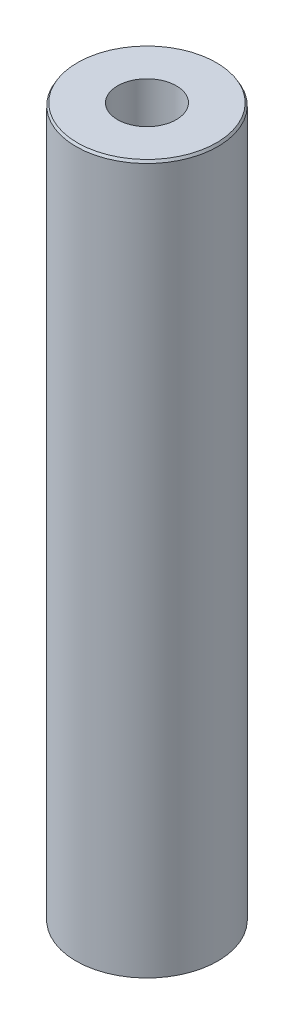
ISO-10303-21;
HEADER;
FILE_DESCRIPTION(('STEP AP214'),'2;1');
FILE_NAME('part.step','',(''),(''),'','','');
FILE_SCHEMA(('AUTOMOTIVE_DESIGN { 1 0 10303 214 1 1 1 1 }'));
ENDSEC;
DATA;
#1=APPLICATION_CONTEXT('core data for automotive mechanical design processes');
#2=APPLICATION_PROTOCOL_DEFINITION('international standard','automotive_design',2000,#1);
#3=PRODUCT_CONTEXT('',#1,'mechanical');
#4=PRODUCT('Part','Part','',(#3));
#5=PRODUCT_RELATED_PRODUCT_CATEGORY('part','',(#4));
#6=PRODUCT_DEFINITION_FORMATION('','',#4);
#7=PRODUCT_DEFINITION_CONTEXT('part definition',#1,'design');
#8=PRODUCT_DEFINITION('design','',#6,#7);
#9=PRODUCT_DEFINITION_SHAPE('','',#8);
#10=(LENGTH_UNIT() NAMED_UNIT(*) SI_UNIT(.MILLI.,.METRE.));
#11=(NAMED_UNIT(*) PLANE_ANGLE_UNIT() SI_UNIT($,.RADIAN.));
#12=(NAMED_UNIT(*) SI_UNIT($,.STERADIAN.) SOLID_ANGLE_UNIT());
#13=UNCERTAINTY_MEASURE_WITH_UNIT(LENGTH_MEASURE(1.E-05),#10,'distance_accuracy_value','');
#14=(GEOMETRIC_REPRESENTATION_CONTEXT(3) GLOBAL_UNCERTAINTY_ASSIGNED_CONTEXT((#13)) GLOBAL_UNIT_ASSIGNED_CONTEXT((#10,
#11,#12)) REPRESENTATION_CONTEXT('',''));
#15=CARTESIAN_POINT('',(0.,0.,0.));
#16=DIRECTION('',(0.,0.,1.));
#17=DIRECTION('',(1.,0.,0.));
#18=AXIS2_PLACEMENT_3D('',#15,#16,#17);
#19=CARTESIAN_POINT('',(0.,600.,0.));
#20=DIRECTION('',(0.,-1.,0.));
#21=DIRECTION('',(0.,0.,-1.));
#22=AXIS2_PLACEMENT_3D('',#19,#20,#21);
#23=CYLINDRICAL_SURFACE('',#22,60.);
#24=CARTESIAN_POINT('',(0.,597.880887931979,0.));
#25=DIRECTION('',(0.,1.,0.));
#26=DIRECTION('',(0.,0.,1.));
#27=AXIS2_PLACEMENT_3D('',#24,#25,#26);
#28=CIRCLE('',#27,60.);
#29=CARTESIAN_POINT('',(0.,597.880887931979,60.));
#30=VERTEX_POINT('',#29);
#31=EDGE_CURVE('E50',#30,#30,#28,.F.);
#32=ORIENTED_EDGE('',*,*,#31,.T.);
#33=EDGE_LOOP('',(#32));
#34=FACE_BOUND('',#33,.T.);
#35=CARTESIAN_POINT('',(0.,1.22346992291478,0.));
#36=DIRECTION('',(0.,1.,0.));
#37=DIRECTION('',(0.,0.,1.));
#38=AXIS2_PLACEMENT_3D('',#35,#36,#37);
#39=CIRCLE('',#38,60.);
#40=CARTESIAN_POINT('',(0.,1.22346992291478,60.));
#41=VERTEX_POINT('',#40);
#42=EDGE_CURVE('E51',#41,#41,#39,.T.);
#43=ORIENTED_EDGE('',*,*,#42,.T.);
#44=EDGE_LOOP('',(#43));
#45=FACE_BOUND('',#44,.T.);
#46=ADVANCED_FACE('F39',(#34,#45),#23,.T.);
#47=CARTESIAN_POINT('',(0.,600.,0.));
#48=DIRECTION('',(0.,1.,0.));
#49=DIRECTION('',(0.,0.,1.));
#50=AXIS2_PLACEMENT_3D('',#47,#48,#49);
#51=PLANE('',#50);
#52=CARTESIAN_POINT('',(0.,600.,0.));
#53=DIRECTION('',(0.,1.,0.));
#54=DIRECTION('',(0.,0.,1.));
#55=AXIS2_PLACEMENT_3D('',#52,#53,#54);
#56=CIRCLE('',#55,58.7765300770852);
#57=CARTESIAN_POINT('',(0.,600.,58.7765300770852));
#58=VERTEX_POINT('',#57);
#59=EDGE_CURVE('E54',#58,#58,#56,.T.);
#60=ORIENTED_EDGE('',*,*,#59,.T.);
#61=EDGE_LOOP('',(#60));
#62=FACE_BOUND('',#61,.T.);
#63=CARTESIAN_POINT('',(0.,600.,0.));
#64=DIRECTION('',(0.,1.,0.));
#65=DIRECTION('',(0.,0.,1.));
#66=AXIS2_PLACEMENT_3D('',#63,#64,#65);
#67=CIRCLE('',#66,24.8455601232884);
#68=CARTESIAN_POINT('',(0.,600.,24.8455601232884));
#69=VERTEX_POINT('',#68);
#70=EDGE_CURVE('E58',#69,#69,#67,.T.);
#71=ORIENTED_EDGE('',*,*,#70,.F.);
#72=EDGE_LOOP('',(#71));
#73=FACE_BOUND('',#72,.T.);
#74=ADVANCED_FACE('F69',(#62,#73),#51,.T.);
#75=CARTESIAN_POINT('',(0.,0.,0.));
#76=DIRECTION('',(0.,1.,0.));
#77=DIRECTION('',(0.,0.,1.));
#78=AXIS2_PLACEMENT_3D('',#75,#76,#77);
#79=PLANE('',#78);
#80=CARTESIAN_POINT('',(0.,0.,0.));
#81=DIRECTION('',(0.,1.,0.));
#82=DIRECTION('',(0.,0.,1.));
#83=AXIS2_PLACEMENT_3D('',#80,#81,#82);
#84=CIRCLE('',#83,57.8808879319792);
#85=CARTESIAN_POINT('',(0.,0.,57.8808879319792));
#86=VERTEX_POINT('',#85);
#87=EDGE_CURVE('E10',#86,#86,#84,.F.);
#88=ORIENTED_EDGE('',*,*,#87,.T.);
#89=EDGE_LOOP('',(#88));
#90=FACE_BOUND('',#89,.T.);
#91=CARTESIAN_POINT('',(0.,0.,0.));
#92=DIRECTION('',(0.,1.,0.));
#93=DIRECTION('',(0.,0.,1.));
#94=AXIS2_PLACEMENT_3D('',#91,#92,#93);
#95=CIRCLE('',#94,24.8455601232884);
#96=CARTESIAN_POINT('',(0.,0.,24.8455601232884));
#97=VERTEX_POINT('',#96);
#98=EDGE_CURVE('E63',#97,#97,#95,.T.);
#99=ORIENTED_EDGE('',*,*,#98,.T.);
#100=EDGE_LOOP('',(#99));
#101=FACE_BOUND('',#100,.T.);
#102=ADVANCED_FACE('F75',(#90,#101),#79,.F.);
#103=CARTESIAN_POINT('',(0.,600.,0.));
#104=DIRECTION('',(0.,-1.,0.));
#105=DIRECTION('',(0.,0.,-1.));
#106=AXIS2_PLACEMENT_3D('',#103,#104,#105);
#107=CYLINDRICAL_SURFACE('',#106,24.8455601232884);
#108=ORIENTED_EDGE('',*,*,#70,.T.);
#109=EDGE_LOOP('',(#108));
#110=FACE_BOUND('',#109,.T.);
#111=ORIENTED_EDGE('',*,*,#98,.F.);
#112=EDGE_LOOP('',(#111));
#113=FACE_BOUND('',#112,.T.);
#114=ADVANCED_FACE('F70',(#110,#113),#107,.F.);
#115=CARTESIAN_POINT('',(0.,600.,0.));
#116=DIRECTION('',(0.,-1.,0.));
#117=DIRECTION('',(0.,0.,-1.));
#118=AXIS2_PLACEMENT_3D('',#115,#116,#117);
#119=CONICAL_SURFACE('',#118,58.7765300770852,0.523598775598281);
#120=ORIENTED_EDGE('',*,*,#31,.F.);
#121=EDGE_LOOP('',(#120));
#122=FACE_BOUND('',#121,.T.);
#123=ORIENTED_EDGE('',*,*,#59,.F.);
#124=EDGE_LOOP('',(#123));
#125=FACE_BOUND('',#124,.T.);
#126=ADVANCED_FACE('F81',(#122,#125),#119,.T.);
#127=CARTESIAN_POINT('',(0.,1.22346992291478,0.));
#128=DIRECTION('',(0.,1.,0.));
#129=DIRECTION('',(0.,0.,1.));
#130=AXIS2_PLACEMENT_3D('',#127,#128,#129);
#131=CONICAL_SURFACE('',#130,60.,1.04719755119661);
#132=ORIENTED_EDGE('',*,*,#87,.F.);
#133=EDGE_LOOP('',(#132));
#134=FACE_BOUND('',#133,.T.);
#135=ORIENTED_EDGE('',*,*,#42,.F.);
#136=EDGE_LOOP('',(#135));
#137=FACE_BOUND('',#136,.T.);
#138=ADVANCED_FACE('F45',(#134,#137),#131,.T.);
#139=CLOSED_SHELL('',(#46,#74,#102,#114,#126,#138));
#140=MANIFOLD_SOLID_BREP('B2',#139);
#141=ADVANCED_BREP_SHAPE_REPRESENTATION('',(#18,#140),#14);
#142=SHAPE_DEFINITION_REPRESENTATION(#9,#141);
ENDSEC;
END-ISO-10303-21;
